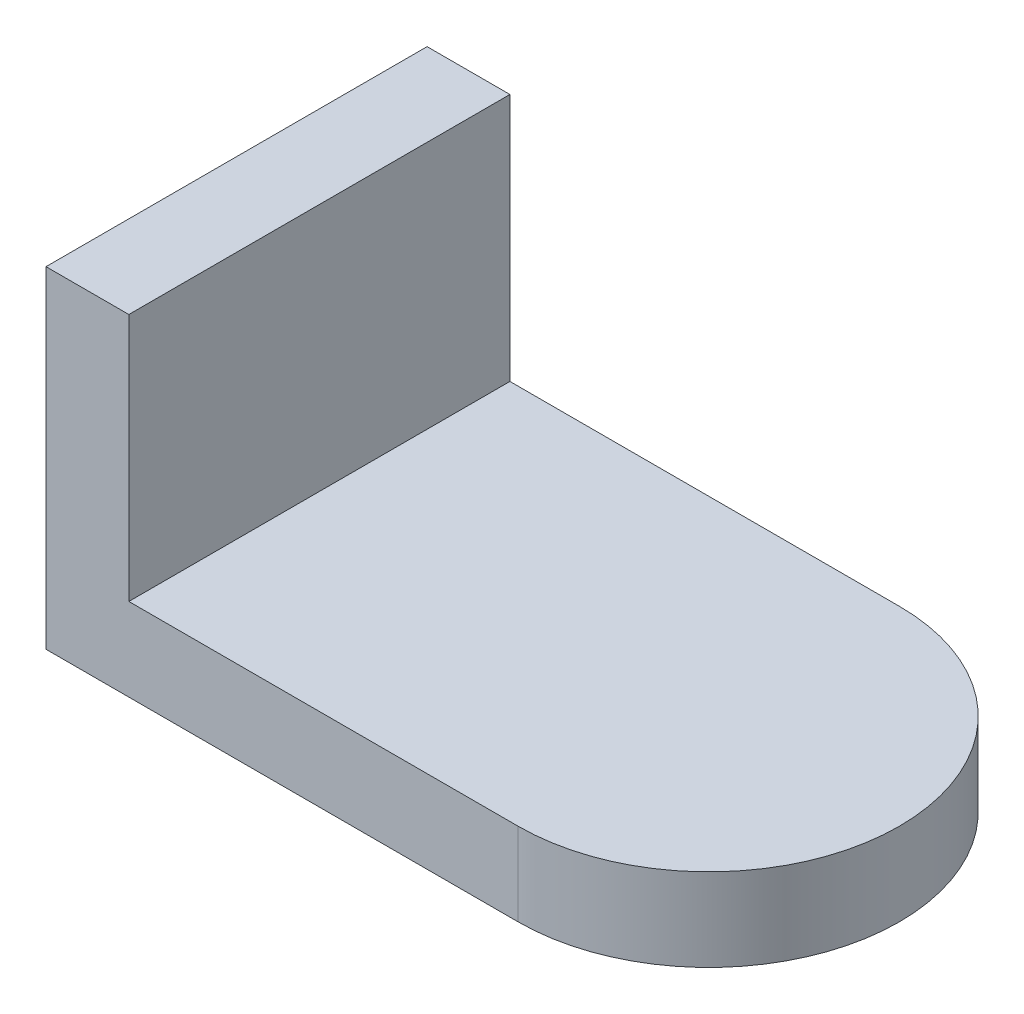
ISO-10303-21;
HEADER;
FILE_DESCRIPTION(('STEP AP214'),'2;1');
FILE_NAME('part.step','',(''),(''),'','','');
FILE_SCHEMA(('AUTOMOTIVE_DESIGN { 1 0 10303 214 1 1 1 1 }'));
ENDSEC;
DATA;
#1=APPLICATION_CONTEXT('core data for automotive mechanical design processes');
#2=APPLICATION_PROTOCOL_DEFINITION('international standard','automotive_design',2000,#1);
#3=PRODUCT_CONTEXT('',#1,'mechanical');
#4=PRODUCT('Part','Part','',(#3));
#5=PRODUCT_RELATED_PRODUCT_CATEGORY('part','',(#4));
#6=PRODUCT_DEFINITION_FORMATION('','',#4);
#7=PRODUCT_DEFINITION_CONTEXT('part definition',#1,'design');
#8=PRODUCT_DEFINITION('design','',#6,#7);
#9=PRODUCT_DEFINITION_SHAPE('','',#8);
#10=(LENGTH_UNIT() NAMED_UNIT(*) SI_UNIT(.MILLI.,.METRE.));
#11=(NAMED_UNIT(*) PLANE_ANGLE_UNIT() SI_UNIT($,.RADIAN.));
#12=(NAMED_UNIT(*) SI_UNIT($,.STERADIAN.) SOLID_ANGLE_UNIT());
#13=UNCERTAINTY_MEASURE_WITH_UNIT(LENGTH_MEASURE(1.E-05),#10,'distance_accuracy_value','');
#14=(GEOMETRIC_REPRESENTATION_CONTEXT(3) GLOBAL_UNCERTAINTY_ASSIGNED_CONTEXT((#13)) GLOBAL_UNIT_ASSIGNED_CONTEXT((#10,
#11,#12)) REPRESENTATION_CONTEXT('',''));
#15=CARTESIAN_POINT('',(0.,0.,0.));
#16=DIRECTION('',(0.,0.,1.));
#17=DIRECTION('',(1.,0.,0.));
#18=AXIS2_PLACEMENT_3D('',#15,#16,#17);
#19=CARTESIAN_POINT('',(-1.45,-0.2,-0.365));
#20=DIRECTION('',(0.,0.,-1.));
#21=DIRECTION('',(-1.,0.,0.));
#22=AXIS2_PLACEMENT_3D('',#19,#20,#21);
#23=PLANE('',#22);
#24=DIRECTION('',(0.,-1.,0.));
#25=VECTOR('',#24,1.);
#26=CARTESIAN_POINT('',(-1.5,-0.2,-0.365));
#27=LINE('',#26,#25);
#28=CARTESIAN_POINT('',(-1.5,-0.2,-0.365));
#29=VERTEX_POINT('',#28);
#30=CARTESIAN_POINT('',(-1.5,-0.4,-0.365));
#31=VERTEX_POINT('',#30);
#32=EDGE_CURVE('E11',#29,#31,#27,.T.);
#33=ORIENTED_EDGE('',*,*,#32,.F.);
#34=DIRECTION('',(-1.,0.,0.));
#35=VECTOR('',#34,1.);
#36=CARTESIAN_POINT('',(-1.45,-0.2,-0.365));
#37=LINE('',#36,#35);
#38=CARTESIAN_POINT('',(-1.45,-0.2,-0.365));
#39=VERTEX_POINT('',#38);
#40=EDGE_CURVE('E24',#39,#29,#37,.T.);
#41=ORIENTED_EDGE('',*,*,#40,.F.);
#42=DIRECTION('',(0.,-1.,0.));
#43=VECTOR('',#42,1.);
#44=CARTESIAN_POINT('',(-1.45,-0.2,-0.365));
#45=LINE('',#44,#43);
#46=CARTESIAN_POINT('',(-1.45,-0.35,-0.365));
#47=VERTEX_POINT('',#46);
#48=EDGE_CURVE('E116',#39,#47,#45,.T.);
#49=ORIENTED_EDGE('',*,*,#48,.T.);
#50=DIRECTION('',(1.,0.,0.));
#51=VECTOR('',#50,1.);
#52=CARTESIAN_POINT('',(-1.45,-0.35,-0.365));
#53=LINE('',#52,#51);
#54=CARTESIAN_POINT('',(-1.215,-0.35,-0.365));
#55=VERTEX_POINT('',#54);
#56=EDGE_CURVE('E90',#47,#55,#53,.T.);
#57=ORIENTED_EDGE('',*,*,#56,.T.);
#58=DIRECTION('',(0.,-1.,0.));
#59=VECTOR('',#58,1.);
#60=CARTESIAN_POINT('',(-1.215,-0.35,-0.365));
#61=LINE('',#60,#59);
#62=CARTESIAN_POINT('',(-1.215,-0.4,-0.365));
#63=VERTEX_POINT('',#62);
#64=EDGE_CURVE('E113',#55,#63,#61,.T.);
#65=ORIENTED_EDGE('',*,*,#64,.T.);
#66=DIRECTION('',(-1.,0.,0.));
#67=VECTOR('',#66,1.);
#68=CARTESIAN_POINT('',(-1.45,-0.4,-0.365));
#69=LINE('',#68,#67);
#70=EDGE_CURVE('E111',#63,#31,#69,.T.);
#71=ORIENTED_EDGE('',*,*,#70,.T.);
#72=EDGE_LOOP('',(#33,#41,#49,#57,#65,#71));
#73=FACE_BOUND('',#72,.T.);
#74=ADVANCED_FACE('F17',(#73),#23,.T.);
#75=CARTESIAN_POINT('',(-1.45,-0.2,-0.365));
#76=DIRECTION('',(0.,1.,0.));
#77=DIRECTION('',(0.,0.,1.));
#78=AXIS2_PLACEMENT_3D('',#75,#76,#77);
#79=PLANE('',#78);
#80=DIRECTION('',(0.,0.,-1.));
#81=VECTOR('',#80,1.);
#82=CARTESIAN_POINT('',(-1.5,-0.2,-0.365));
#83=LINE('',#82,#81);
#84=CARTESIAN_POINT('',(-1.5,-0.2,-0.135));
#85=VERTEX_POINT('',#84);
#86=EDGE_CURVE('E109',#85,#29,#83,.T.);
#87=ORIENTED_EDGE('',*,*,#86,.F.);
#88=DIRECTION('',(-1.,0.,0.));
#89=VECTOR('',#88,1.);
#90=CARTESIAN_POINT('',(-1.45,-0.2,-0.135));
#91=LINE('',#90,#89);
#92=CARTESIAN_POINT('',(-1.45,-0.2,-0.135));
#93=VERTEX_POINT('',#92);
#94=EDGE_CURVE('E107',#93,#85,#91,.T.);
#95=ORIENTED_EDGE('',*,*,#94,.F.);
#96=DIRECTION('',(0.,0.,-1.));
#97=VECTOR('',#96,1.);
#98=CARTESIAN_POINT('',(-1.45,-0.2,-0.365));
#99=LINE('',#98,#97);
#100=EDGE_CURVE('E85',#93,#39,#99,.T.);
#101=ORIENTED_EDGE('',*,*,#100,.T.);
#102=ORIENTED_EDGE('',*,*,#40,.T.);
#103=EDGE_LOOP('',(#87,#95,#101,#102));
#104=FACE_BOUND('',#103,.T.);
#105=ADVANCED_FACE('F118',(#104),#79,.T.);
#106=CARTESIAN_POINT('',(-1.45,-0.2,-0.135));
#107=DIRECTION('',(0.,0.,1.));
#108=DIRECTION('',(0.,-1.,0.));
#109=AXIS2_PLACEMENT_3D('',#106,#107,#108);
#110=PLANE('',#109);
#111=DIRECTION('',(0.,1.,0.));
#112=VECTOR('',#111,1.);
#113=CARTESIAN_POINT('',(-1.5,-0.2,-0.135));
#114=LINE('',#113,#112);
#115=CARTESIAN_POINT('',(-1.5,-0.4,-0.134999999999999));
#116=VERTEX_POINT('',#115);
#117=EDGE_CURVE('E103',#116,#85,#114,.T.);
#118=ORIENTED_EDGE('',*,*,#117,.F.);
#119=DIRECTION('',(-1.,0.,0.));
#120=VECTOR('',#119,1.);
#121=CARTESIAN_POINT('',(-1.45,-0.4,-0.134999999999999));
#122=LINE('',#121,#120);
#123=CARTESIAN_POINT('',(-1.215,-0.4,-0.134999999999999));
#124=VERTEX_POINT('',#123);
#125=EDGE_CURVE('E100',#124,#116,#122,.T.);
#126=ORIENTED_EDGE('',*,*,#125,.F.);
#127=DIRECTION('',(0.,-1.,0.));
#128=VECTOR('',#127,1.);
#129=CARTESIAN_POINT('',(-1.215,-0.35,-0.134999999999999));
#130=LINE('',#129,#128);
#131=CARTESIAN_POINT('',(-1.215,-0.35,-0.134999999999999));
#132=VERTEX_POINT('',#131);
#133=EDGE_CURVE('E72',#132,#124,#130,.T.);
#134=ORIENTED_EDGE('',*,*,#133,.F.);
#135=DIRECTION('',(-1.,0.,0.));
#136=VECTOR('',#135,1.);
#137=CARTESIAN_POINT('',(-1.45,-0.35,-0.135));
#138=LINE('',#137,#136);
#139=CARTESIAN_POINT('',(-1.45,-0.35,-0.135));
#140=VERTEX_POINT('',#139);
#141=EDGE_CURVE('E66',#132,#140,#138,.T.);
#142=ORIENTED_EDGE('',*,*,#141,.T.);
#143=DIRECTION('',(0.,1.,0.));
#144=VECTOR('',#143,1.);
#145=CARTESIAN_POINT('',(-1.45,-0.2,-0.135));
#146=LINE('',#145,#144);
#147=EDGE_CURVE('E70',#140,#93,#146,.T.);
#148=ORIENTED_EDGE('',*,*,#147,.T.);
#149=ORIENTED_EDGE('',*,*,#94,.T.);
#150=EDGE_LOOP('',(#118,#126,#134,#142,#148,#149));
#151=FACE_BOUND('',#150,.T.);
#152=ADVANCED_FACE('F68',(#151),#110,.T.);
#153=CARTESIAN_POINT('',(-1.45,-0.4,-0.365));
#154=DIRECTION('',(0.,-1.,0.));
#155=DIRECTION('',(0.,0.,-1.));
#156=AXIS2_PLACEMENT_3D('',#153,#154,#155);
#157=PLANE('',#156);
#158=DIRECTION('',(0.,0.,1.));
#159=VECTOR('',#158,1.);
#160=CARTESIAN_POINT('',(-1.5,-0.4,-0.365));
#161=LINE('',#160,#159);
#162=EDGE_CURVE('E86',#31,#116,#161,.T.);
#163=ORIENTED_EDGE('',*,*,#162,.F.);
#164=ORIENTED_EDGE('',*,*,#70,.F.);
#165=CARTESIAN_POINT('',(-1.215,-0.4,-0.249999999999999));
#166=DIRECTION('',(0.,-1.,0.));
#167=DIRECTION('',(0.,0.,1.));
#168=AXIS2_PLACEMENT_3D('',#165,#166,#167);
#169=CIRCLE('',#168,0.115);
#170=EDGE_CURVE('E91',#63,#124,#169,.T.);
#171=ORIENTED_EDGE('',*,*,#170,.T.);
#172=ORIENTED_EDGE('',*,*,#125,.T.);
#173=EDGE_LOOP('',(#163,#164,#171,#172));
#174=FACE_BOUND('',#173,.T.);
#175=ADVANCED_FACE('F122',(#174),#157,.T.);
#176=CARTESIAN_POINT('',(-1.45,0.,0.));
#177=DIRECTION('',(-1.,0.,0.));
#178=DIRECTION('',(0.,0.,1.));
#179=AXIS2_PLACEMENT_3D('',#176,#177,#178);
#180=PLANE('',#179);
#181=ORIENTED_EDGE('',*,*,#147,.F.);
#182=DIRECTION('',(0.,0.,-1.));
#183=VECTOR('',#182,1.);
#184=CARTESIAN_POINT('',(-1.45,-0.35,-0.365));
#185=LINE('',#184,#183);
#186=EDGE_CURVE('E83',#140,#47,#185,.T.);
#187=ORIENTED_EDGE('',*,*,#186,.T.);
#188=ORIENTED_EDGE('',*,*,#48,.F.);
#189=ORIENTED_EDGE('',*,*,#100,.F.);
#190=EDGE_LOOP('',(#181,#187,#188,#189));
#191=FACE_BOUND('',#190,.T.);
#192=ADVANCED_FACE('F81',(#191),#180,.F.);
#193=CARTESIAN_POINT('',(-1.5,0.,0.));
#194=DIRECTION('',(-1.,0.,0.));
#195=DIRECTION('',(0.,0.,1.));
#196=AXIS2_PLACEMENT_3D('',#193,#194,#195);
#197=PLANE('',#196);
#198=ORIENTED_EDGE('',*,*,#32,.T.);
#199=ORIENTED_EDGE('',*,*,#162,.T.);
#200=ORIENTED_EDGE('',*,*,#117,.T.);
#201=ORIENTED_EDGE('',*,*,#86,.T.);
#202=EDGE_LOOP('',(#198,#199,#200,#201));
#203=FACE_BOUND('',#202,.T.);
#204=ADVANCED_FACE('F119',(#203),#197,.T.);
#205=CARTESIAN_POINT('',(-1.215,-0.35,-0.249999999999999));
#206=DIRECTION('',(0.,-1.,0.));
#207=DIRECTION('',(0.,0.,-1.));
#208=AXIS2_PLACEMENT_3D('',#205,#206,#207);
#209=CYLINDRICAL_SURFACE('',#208,0.115);
#210=ORIENTED_EDGE('',*,*,#170,.F.);
#211=ORIENTED_EDGE('',*,*,#64,.F.);
#212=CARTESIAN_POINT('',(-1.215,-0.35,-0.249999999999999));
#213=DIRECTION('',(0.,-1.,0.));
#214=DIRECTION('',(0.,0.,1.));
#215=AXIS2_PLACEMENT_3D('',#212,#213,#214);
#216=CIRCLE('',#215,0.115);
#217=EDGE_CURVE('E92',#55,#132,#216,.T.);
#218=ORIENTED_EDGE('',*,*,#217,.T.);
#219=ORIENTED_EDGE('',*,*,#133,.T.);
#220=EDGE_LOOP('',(#210,#211,#218,#219));
#221=FACE_BOUND('',#220,.T.);
#222=ADVANCED_FACE('F127',(#221),#209,.T.);
#223=CARTESIAN_POINT('',(-1.215,-0.35,-0.249999999999999));
#224=DIRECTION('',(0.,1.,0.));
#225=DIRECTION('',(0.,0.,1.));
#226=AXIS2_PLACEMENT_3D('',#223,#224,#225);
#227=PLANE('',#226);
#228=ORIENTED_EDGE('',*,*,#186,.F.);
#229=ORIENTED_EDGE('',*,*,#141,.F.);
#230=ORIENTED_EDGE('',*,*,#217,.F.);
#231=ORIENTED_EDGE('',*,*,#56,.F.);
#232=EDGE_LOOP('',(#228,#229,#230,#231));
#233=FACE_BOUND('',#232,.T.);
#234=ADVANCED_FACE('F89',(#233),#227,.T.);
#235=CLOSED_SHELL('',(#74,#105,#152,#175,#192,#204,#222,#234));
#236=MANIFOLD_SOLID_BREP('B1',#235);
#237=ADVANCED_BREP_SHAPE_REPRESENTATION('',(#18,#236),#14);
#238=SHAPE_DEFINITION_REPRESENTATION(#9,#237);
ENDSEC;
END-ISO-10303-21;
